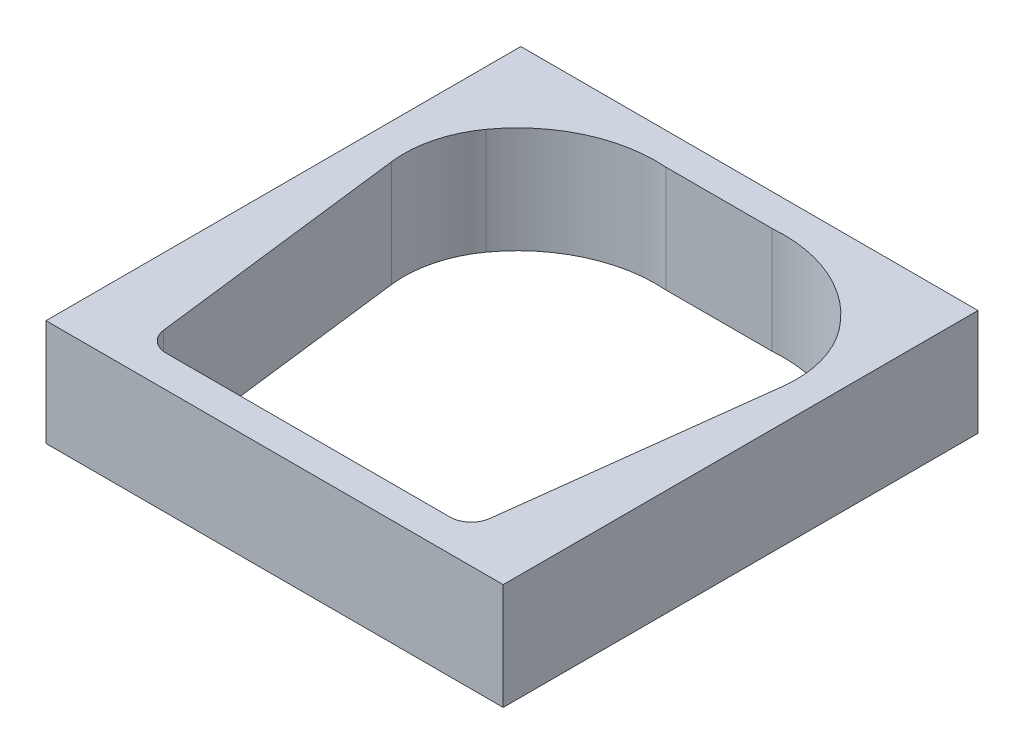
ISO-10303-21;
HEADER;
FILE_DESCRIPTION(('STEP AP214'),'2;1');
FILE_NAME('part.step','',(''),(''),'','','');
FILE_SCHEMA(('AUTOMOTIVE_DESIGN { 1 0 10303 214 1 1 1 1 }'));
ENDSEC;
DATA;
#1=APPLICATION_CONTEXT('core data for automotive mechanical design processes');
#2=APPLICATION_PROTOCOL_DEFINITION('international standard','automotive_design',2000,#1);
#3=PRODUCT_CONTEXT('',#1,'mechanical');
#4=PRODUCT('Part','Part','',(#3));
#5=PRODUCT_RELATED_PRODUCT_CATEGORY('part','',(#4));
#6=PRODUCT_DEFINITION_FORMATION('','',#4);
#7=PRODUCT_DEFINITION_CONTEXT('part definition',#1,'design');
#8=PRODUCT_DEFINITION('design','',#6,#7);
#9=PRODUCT_DEFINITION_SHAPE('','',#8);
#10=(LENGTH_UNIT() NAMED_UNIT(*) SI_UNIT(.MILLI.,.METRE.));
#11=(NAMED_UNIT(*) PLANE_ANGLE_UNIT() SI_UNIT($,.RADIAN.));
#12=(NAMED_UNIT(*) SI_UNIT($,.STERADIAN.) SOLID_ANGLE_UNIT());
#13=UNCERTAINTY_MEASURE_WITH_UNIT(LENGTH_MEASURE(1.E-05),#10,'distance_accuracy_value','');
#14=(GEOMETRIC_REPRESENTATION_CONTEXT(3) GLOBAL_UNCERTAINTY_ASSIGNED_CONTEXT((#13)) GLOBAL_UNIT_ASSIGNED_CONTEXT((#10,
#11,#12)) REPRESENTATION_CONTEXT('',''));
#15=CARTESIAN_POINT('',(0.,0.,0.));
#16=DIRECTION('',(0.,0.,1.));
#17=DIRECTION('',(1.,0.,0.));
#18=AXIS2_PLACEMENT_3D('',#15,#16,#17);
#19=CARTESIAN_POINT('',(12.657693959334,0.,2.96357615590343));
#20=DIRECTION('',(0.,-1.,0.));
#21=DIRECTION('',(0.,0.,-1.));
#22=AXIS2_PLACEMENT_3D('',#19,#20,#21);
#23=PLANE('',#22);
#24=DIRECTION('',(0.,0.,1.));
#25=VECTOR('',#24,1.);
#26=CARTESIAN_POINT('',(-3.,0.,31.6262943685429));
#27=LINE('',#26,#25);
#28=CARTESIAN_POINT('',(-3.,0.,-13.));
#29=VERTEX_POINT('',#28);
#30=CARTESIAN_POINT('',(-3.,0.,31.6262943685429));
#31=VERTEX_POINT('',#30);
#32=EDGE_CURVE('E206',#29,#31,#27,.T.);
#33=ORIENTED_EDGE('',*,*,#32,.F.);
#34=DIRECTION('',(-1.,0.,0.));
#35=VECTOR('',#34,1.);
#36=CARTESIAN_POINT('',(-3.,0.,-13.));
#37=LINE('',#36,#35);
#38=CARTESIAN_POINT('',(39.9705766235171,0.,-13.));
#39=VERTEX_POINT('',#38);
#40=EDGE_CURVE('E187',#39,#29,#37,.T.);
#41=ORIENTED_EDGE('',*,*,#40,.F.);
#42=DIRECTION('',(0.,0.,-1.));
#43=VECTOR('',#42,1.);
#44=CARTESIAN_POINT('',(39.9705766235171,0.,31.6262943685429));
#45=LINE('',#44,#43);
#46=CARTESIAN_POINT('',(39.9705766235171,0.,31.6262943685429));
#47=VERTEX_POINT('',#46);
#48=EDGE_CURVE('E200',#47,#39,#45,.T.);
#49=ORIENTED_EDGE('',*,*,#48,.F.);
#50=DIRECTION('',(1.,0.,0.));
#51=VECTOR('',#50,1.);
#52=CARTESIAN_POINT('',(-3.,0.,31.6262943685429));
#53=LINE('',#52,#51);
#54=EDGE_CURVE('E211',#31,#47,#53,.T.);
#55=ORIENTED_EDGE('',*,*,#54,.F.);
#56=EDGE_LOOP('',(#33,#41,#49,#55));
#57=FACE_BOUND('',#56,.T.);
#58=CARTESIAN_POINT('',(10.2236530300218,0.,1.20988155465921));
#59=DIRECTION('',(0.,-1.,0.));
#60=DIRECTION('',(0.,0.,-1.));
#61=AXIS2_PLACEMENT_3D('',#58,#59,#60);
#62=CIRCLE('',#61,10.);
#63=CARTESIAN_POINT('',(0.298191513608604,0.,2.42857498871066));
#64=VERTEX_POINT('',#63);
#65=CARTESIAN_POINT('',(2.1101832656479,0.,-4.63576711615484));
#66=VERTEX_POINT('',#65);
#67=EDGE_CURVE('E91',#64,#66,#62,.T.);
#68=ORIENTED_EDGE('',*,*,#67,.F.);
#69=DIRECTION('',(0.121869343405145,0.,0.992546151641322));
#70=VECTOR('',#69,1.);
#71=CARTESIAN_POINT('',(0.298191513608603,0.,2.42857498871065));
#72=LINE('',#71,#70);
#73=CARTESIAN_POINT('',(3.29922521014799,0.,26.8700330553532));
#74=VERTEX_POINT('',#73);
#75=EDGE_CURVE('E11',#64,#74,#72,.T.);
#76=ORIENTED_EDGE('',*,*,#75,.T.);
#77=CARTESIAN_POINT('',(5.28431751343064,0.,26.6262943685429));
#78=DIRECTION('',(0.,-1.,0.));
#79=DIRECTION('',(0.,0.,-1.));
#80=AXIS2_PLACEMENT_3D('',#77,#78,#79);
#81=CIRCLE('',#80,2.);
#82=CARTESIAN_POINT('',(5.28431751343065,0.,28.6262943685429));
#83=VERTEX_POINT('',#82);
#84=EDGE_CURVE('E48',#74,#83,#81,.F.);
#85=ORIENTED_EDGE('',*,*,#84,.T.);
#86=DIRECTION('',(1.,0.,0.));
#87=VECTOR('',#86,1.);
#88=CARTESIAN_POINT('',(12.657693959334,0.,28.6262943685429));
#89=LINE('',#88,#87);
#90=CARTESIAN_POINT('',(31.9760056227623,0.,28.626294368543));
#91=VERTEX_POINT('',#90);
#92=EDGE_CURVE('E133',#83,#91,#89,.T.);
#93=ORIENTED_EDGE('',*,*,#92,.T.);
#94=CARTESIAN_POINT('',(31.9760056227623,0.,26.6262943685429));
#95=DIRECTION('',(0.,-1.,0.));
#96=DIRECTION('',(0.,0.,-1.));
#97=AXIS2_PLACEMENT_3D('',#94,#95,#96);
#98=CIRCLE('',#97,2.00000000000001);
#99=CARTESIAN_POINT('',(33.961097926045,0.,26.8700330553532));
#100=VERTEX_POINT('',#99);
#101=EDGE_CURVE('E129',#91,#100,#98,.F.);
#102=ORIENTED_EDGE('',*,*,#101,.T.);
#103=DIRECTION('',(0.121869343405151,0.,-0.992546151641322));
#104=VECTOR('',#103,1.);
#105=CARTESIAN_POINT('',(33.961097926045,0.,26.8700330553533));
#106=LINE('',#105,#104);
#107=CARTESIAN_POINT('',(36.970576623517,2.22044604925031E-13,2.35979597553153));
#108=VERTEX_POINT('',#107);
#109=EDGE_CURVE('E116',#100,#108,#106,.T.);
#110=ORIENTED_EDGE('',*,*,#109,.T.);
#111=CARTESIAN_POINT('',(27.0451151071038,0.,1.14110254148002));
#112=DIRECTION('',(0.,-1.,0.));
#113=DIRECTION('',(0.,0.,-1.));
#114=AXIS2_PLACEMENT_3D('',#111,#112,#113);
#115=CIRCLE('',#114,10.);
#116=CARTESIAN_POINT('',(34.9994172411373,0.,-4.91934938560512));
#117=VERTEX_POINT('',#116);
#118=EDGE_CURVE('E112',#117,#108,#115,.T.);
#119=ORIENTED_EDGE('',*,*,#118,.F.);
#120=CARTESIAN_POINT('',(24.6588244668938,0.,2.95923811960556));
#121=DIRECTION('',(0.,-1.,0.));
#122=DIRECTION('',(0.,0.,-1.));
#123=AXIS2_PLACEMENT_3D('',#120,#121,#122);
#124=CIRCLE('',#123,13.);
#125=CARTESIAN_POINT('',(23.6301615680965,0.,-10.));
#126=VERTEX_POINT('',#125);
#127=EDGE_CURVE('E118',#126,#117,#124,.T.);
#128=ORIENTED_EDGE('',*,*,#127,.F.);
#129=DIRECTION('',(1.,0.,0.));
#130=VECTOR('',#129,1.);
#131=CARTESIAN_POINT('',(12.657693959334,0.,-10.));
#132=LINE('',#131,#130);
#133=CARTESIAN_POINT('',(13.6301615680965,0.,-10.));
#134=VERTEX_POINT('',#133);
#135=EDGE_CURVE('E122',#126,#134,#132,.F.);
#136=ORIENTED_EDGE('',*,*,#135,.T.);
#137=CARTESIAN_POINT('',(12.657693959334,0.,2.96357615590343));
#138=DIRECTION('',(0.,-1.,0.));
#139=DIRECTION('',(0.,0.,-1.));
#140=AXIS2_PLACEMENT_3D('',#137,#138,#139);
#141=CIRCLE('',#140,13.);
#142=EDGE_CURVE('E110',#66,#134,#141,.T.);
#143=ORIENTED_EDGE('',*,*,#142,.F.);
#144=EDGE_LOOP('',(#68,#76,#85,#93,#102,#110,#119,#128,#136,#143));
#145=FACE_BOUND('',#144,.T.);
#146=ADVANCED_FACE('F39',(#57,#145),#23,.T.);
#147=CARTESIAN_POINT('',(0.,10.,0.));
#148=DIRECTION('',(0.,-1.,0.));
#149=DIRECTION('',(0.,0.,-1.));
#150=AXIS2_PLACEMENT_3D('',#147,#148,#149);
#151=PLANE('',#150);
#152=DIRECTION('',(0.,0.,1.));
#153=VECTOR('',#152,1.);
#154=CARTESIAN_POINT('',(-3.,10.,31.6262943685429));
#155=LINE('',#154,#153);
#156=CARTESIAN_POINT('',(-3.,10.,-13.));
#157=VERTEX_POINT('',#156);
#158=CARTESIAN_POINT('',(-3.,10.,31.6262943685429));
#159=VERTEX_POINT('',#158);
#160=EDGE_CURVE('E199',#157,#159,#155,.T.);
#161=ORIENTED_EDGE('',*,*,#160,.T.);
#162=DIRECTION('',(1.,0.,0.));
#163=VECTOR('',#162,1.);
#164=CARTESIAN_POINT('',(-3.,10.,31.6262943685429));
#165=LINE('',#164,#163);
#166=CARTESIAN_POINT('',(39.9705766235171,10.,31.6262943685429));
#167=VERTEX_POINT('',#166);
#168=EDGE_CURVE('E311',#159,#167,#165,.T.);
#169=ORIENTED_EDGE('',*,*,#168,.T.);
#170=DIRECTION('',(0.,0.,-1.));
#171=VECTOR('',#170,1.);
#172=CARTESIAN_POINT('',(39.9705766235171,10.,31.6262943685429));
#173=LINE('',#172,#171);
#174=CARTESIAN_POINT('',(39.9705766235171,10.,-13.));
#175=VERTEX_POINT('',#174);
#176=EDGE_CURVE('E313',#167,#175,#173,.T.);
#177=ORIENTED_EDGE('',*,*,#176,.T.);
#178=DIRECTION('',(-1.,0.,0.));
#179=VECTOR('',#178,1.);
#180=CARTESIAN_POINT('',(-3.,10.,-13.));
#181=LINE('',#180,#179);
#182=EDGE_CURVE('E209',#175,#157,#181,.T.);
#183=ORIENTED_EDGE('',*,*,#182,.T.);
#184=EDGE_LOOP('',(#161,#169,#177,#183));
#185=FACE_BOUND('',#184,.T.);
#186=CARTESIAN_POINT('',(10.2236530300218,9.99999999999979,1.20988155465921));
#187=DIRECTION('',(0.,-1.,0.));
#188=DIRECTION('',(0.,0.,-1.));
#189=AXIS2_PLACEMENT_3D('',#186,#187,#188);
#190=CIRCLE('',#189,10.);
#191=CARTESIAN_POINT('',(0.298191513608606,10.0000000000001,2.42857498871065));
#192=VERTEX_POINT('',#191);
#193=CARTESIAN_POINT('',(2.1101832656479,10.,-4.63576711615484));
#194=VERTEX_POINT('',#193);
#195=EDGE_CURVE('E95',#192,#194,#190,.T.);
#196=ORIENTED_EDGE('',*,*,#195,.T.);
#197=CARTESIAN_POINT('',(12.657693959334,9.99999999999979,2.96357615590343));
#198=DIRECTION('',(0.,-1.,0.));
#199=DIRECTION('',(0.,0.,-1.));
#200=AXIS2_PLACEMENT_3D('',#197,#198,#199);
#201=CIRCLE('',#200,13.);
#202=CARTESIAN_POINT('',(13.6301615680965,9.9999999999999,-10.));
#203=VERTEX_POINT('',#202);
#204=EDGE_CURVE('E262',#194,#203,#201,.T.);
#205=ORIENTED_EDGE('',*,*,#204,.T.);
#206=DIRECTION('',(1.,0.,0.));
#207=VECTOR('',#206,1.);
#208=CARTESIAN_POINT('',(13.6301615680965,9.99999999999979,-10.));
#209=LINE('',#208,#207);
#210=CARTESIAN_POINT('',(23.6301615680965,9.99999999999979,-10.));
#211=VERTEX_POINT('',#210);
#212=EDGE_CURVE('E125',#203,#211,#209,.T.);
#213=ORIENTED_EDGE('',*,*,#212,.T.);
#214=CARTESIAN_POINT('',(24.6588244668938,9.99999999999979,2.95923811960556));
#215=DIRECTION('',(0.,-1.,0.));
#216=DIRECTION('',(0.,0.,-1.));
#217=AXIS2_PLACEMENT_3D('',#214,#215,#216);
#218=CIRCLE('',#217,13.);
#219=CARTESIAN_POINT('',(34.9994172411373,10.,-4.91934938560512));
#220=VERTEX_POINT('',#219);
#221=EDGE_CURVE('E235',#211,#220,#218,.T.);
#222=ORIENTED_EDGE('',*,*,#221,.T.);
#223=CARTESIAN_POINT('',(27.0451151071038,9.99999999999979,1.14110254148002));
#224=DIRECTION('',(0.,-1.,0.));
#225=DIRECTION('',(0.,0.,-1.));
#226=AXIS2_PLACEMENT_3D('',#223,#224,#225);
#227=CIRCLE('',#226,10.);
#228=CARTESIAN_POINT('',(36.970576623517,10.0000000000001,2.35979597553153));
#229=VERTEX_POINT('',#228);
#230=EDGE_CURVE('E239',#220,#229,#227,.T.);
#231=ORIENTED_EDGE('',*,*,#230,.T.);
#232=DIRECTION('',(-0.121869343405151,0.,0.992546151641322));
#233=VECTOR('',#232,1.);
#234=CARTESIAN_POINT('',(36.970576623517,9.99999999999979,2.35979597553153));
#235=LINE('',#234,#233);
#236=CARTESIAN_POINT('',(33.961097926045,9.99999999999979,26.8700330553532));
#237=VERTEX_POINT('',#236);
#238=EDGE_CURVE('E243',#229,#237,#235,.T.);
#239=ORIENTED_EDGE('',*,*,#238,.T.);
#240=CARTESIAN_POINT('',(31.9760056227623,9.99999999999979,26.6262943685429));
#241=DIRECTION('',(0.,-1.,0.));
#242=DIRECTION('',(0.,0.,-1.));
#243=AXIS2_PLACEMENT_3D('',#240,#241,#242);
#244=CIRCLE('',#243,2.);
#245=CARTESIAN_POINT('',(31.9760056227623,9.99999999999979,28.626294368543));
#246=VERTEX_POINT('',#245);
#247=EDGE_CURVE('E247',#237,#246,#244,.T.);
#248=ORIENTED_EDGE('',*,*,#247,.T.);
#249=DIRECTION('',(-1.,0.,0.));
#250=VECTOR('',#249,1.);
#251=CARTESIAN_POINT('',(5.28431751343065,9.99999999999979,28.6262943685429));
#252=LINE('',#251,#250);
#253=CARTESIAN_POINT('',(5.28431751343065,9.99999999999979,28.6262943685429));
#254=VERTEX_POINT('',#253);
#255=EDGE_CURVE('E251',#246,#254,#252,.T.);
#256=ORIENTED_EDGE('',*,*,#255,.T.);
#257=CARTESIAN_POINT('',(5.28431751343064,9.99999999999979,26.6262943685429));
#258=DIRECTION('',(0.,-1.,0.));
#259=DIRECTION('',(0.,0.,-1.));
#260=AXIS2_PLACEMENT_3D('',#257,#258,#259);
#261=CIRCLE('',#260,2.);
#262=CARTESIAN_POINT('',(3.29922521014799,9.99999999999979,26.8700330553532));
#263=VERTEX_POINT('',#262);
#264=EDGE_CURVE('E255',#254,#263,#261,.T.);
#265=ORIENTED_EDGE('',*,*,#264,.T.);
#266=DIRECTION('',(-0.121869343405144,0.,-0.992546151641323));
#267=VECTOR('',#266,1.);
#268=CARTESIAN_POINT('',(0.298191513608607,9.99999999999979,2.42857498871066));
#269=LINE('',#268,#267);
#270=EDGE_CURVE('E147',#263,#192,#269,.T.);
#271=ORIENTED_EDGE('',*,*,#270,.T.);
#272=EDGE_LOOP('',(#196,#205,#213,#222,#231,#239,#248,#256,#265,#271));
#273=FACE_BOUND('',#272,.T.);
#274=ADVANCED_FACE('F318',(#185,#273),#151,.F.);
#275=CARTESIAN_POINT('',(-3.,10.,31.6262943685429));
#276=DIRECTION('',(1.,0.,0.));
#277=DIRECTION('',(0.,0.,-1.));
#278=AXIS2_PLACEMENT_3D('',#275,#276,#277);
#279=PLANE('',#278);
#280=ORIENTED_EDGE('',*,*,#32,.T.);
#281=DIRECTION('',(0.,-1.,0.));
#282=VECTOR('',#281,1.);
#283=CARTESIAN_POINT('',(-3.,10.,31.6262943685429));
#284=LINE('',#283,#282);
#285=EDGE_CURVE('E232',#159,#31,#284,.T.);
#286=ORIENTED_EDGE('',*,*,#285,.F.);
#287=ORIENTED_EDGE('',*,*,#160,.F.);
#288=DIRECTION('',(0.,-1.,0.));
#289=VECTOR('',#288,1.);
#290=CARTESIAN_POINT('',(-3.,10.,-13.));
#291=LINE('',#290,#289);
#292=EDGE_CURVE('E191',#157,#29,#291,.T.);
#293=ORIENTED_EDGE('',*,*,#292,.T.);
#294=EDGE_LOOP('',(#280,#286,#287,#293));
#295=FACE_BOUND('',#294,.T.);
#296=ADVANCED_FACE('F204',(#295),#279,.F.);
#297=CARTESIAN_POINT('',(-3.,10.,31.6262943685429));
#298=DIRECTION('',(0.,0.,-1.));
#299=DIRECTION('',(-1.,0.,0.));
#300=AXIS2_PLACEMENT_3D('',#297,#298,#299);
#301=PLANE('',#300);
#302=ORIENTED_EDGE('',*,*,#54,.T.);
#303=DIRECTION('',(0.,-1.,0.));
#304=VECTOR('',#303,1.);
#305=CARTESIAN_POINT('',(39.9705766235171,10.,31.6262943685429));
#306=LINE('',#305,#304);
#307=EDGE_CURVE('E228',#167,#47,#306,.T.);
#308=ORIENTED_EDGE('',*,*,#307,.F.);
#309=ORIENTED_EDGE('',*,*,#168,.F.);
#310=ORIENTED_EDGE('',*,*,#285,.T.);
#311=EDGE_LOOP('',(#302,#308,#309,#310));
#312=FACE_BOUND('',#311,.T.);
#313=ADVANCED_FACE('F322',(#312),#301,.F.);
#314=CARTESIAN_POINT('',(39.9705766235171,10.,31.6262943685429));
#315=DIRECTION('',(-1.,0.,0.));
#316=DIRECTION('',(0.,0.,1.));
#317=AXIS2_PLACEMENT_3D('',#314,#315,#316);
#318=PLANE('',#317);
#319=ORIENTED_EDGE('',*,*,#48,.T.);
#320=DIRECTION('',(0.,-1.,0.));
#321=VECTOR('',#320,1.);
#322=CARTESIAN_POINT('',(39.9705766235171,10.,-13.));
#323=LINE('',#322,#321);
#324=EDGE_CURVE('E194',#175,#39,#323,.T.);
#325=ORIENTED_EDGE('',*,*,#324,.F.);
#326=ORIENTED_EDGE('',*,*,#176,.F.);
#327=ORIENTED_EDGE('',*,*,#307,.T.);
#328=EDGE_LOOP('',(#319,#325,#326,#327));
#329=FACE_BOUND('',#328,.T.);
#330=ADVANCED_FACE('F324',(#329),#318,.F.);
#331=CARTESIAN_POINT('',(-3.,10.,-13.));
#332=DIRECTION('',(0.,0.,1.));
#333=DIRECTION('',(1.,0.,0.));
#334=AXIS2_PLACEMENT_3D('',#331,#332,#333);
#335=PLANE('',#334);
#336=ORIENTED_EDGE('',*,*,#40,.T.);
#337=ORIENTED_EDGE('',*,*,#292,.F.);
#338=ORIENTED_EDGE('',*,*,#182,.F.);
#339=ORIENTED_EDGE('',*,*,#324,.T.);
#340=EDGE_LOOP('',(#336,#337,#338,#339));
#341=FACE_BOUND('',#340,.T.);
#342=ADVANCED_FACE('F189',(#341),#335,.F.);
#343=CARTESIAN_POINT('',(12.657693959334,-1.2E-05,2.96357615590343));
#344=DIRECTION('',(0.,1.,0.));
#345=DIRECTION('',(0.,0.,1.));
#346=AXIS2_PLACEMENT_3D('',#343,#344,#345);
#347=CYLINDRICAL_SURFACE('',#346,13.);
#348=DIRECTION('',(0.,1.,0.));
#349=VECTOR('',#348,1.);
#350=CARTESIAN_POINT('',(2.1101832656479,-1.2E-05,-4.63576711615484));
#351=LINE('',#350,#349);
#352=EDGE_CURVE('E100',#66,#194,#351,.T.);
#353=ORIENTED_EDGE('',*,*,#352,.F.);
#354=ORIENTED_EDGE('',*,*,#142,.T.);
#355=DIRECTION('',(0.,-1.,0.));
#356=VECTOR('',#355,1.);
#357=CARTESIAN_POINT('',(13.6301615680965,2133.6,-10.));
#358=LINE('',#357,#356);
#359=EDGE_CURVE('E56',#203,#134,#358,.T.);
#360=ORIENTED_EDGE('',*,*,#359,.F.);
#361=ORIENTED_EDGE('',*,*,#204,.F.);
#362=EDGE_LOOP('',(#353,#354,#360,#361));
#363=FACE_BOUND('',#362,.T.);
#364=ADVANCED_FACE('F331',(#363),#347,.F.);
#365=CARTESIAN_POINT('',(24.6588244668938,-1.2E-05,2.95923811960556));
#366=DIRECTION('',(0.,1.,0.));
#367=DIRECTION('',(0.,0.,1.));
#368=AXIS2_PLACEMENT_3D('',#365,#366,#367);
#369=CYLINDRICAL_SURFACE('',#368,13.);
#370=DIRECTION('',(0.,-1.,0.));
#371=VECTOR('',#370,1.);
#372=CARTESIAN_POINT('',(23.6301615680965,2133.6,-10.));
#373=LINE('',#372,#371);
#374=EDGE_CURVE('E275',#211,#126,#373,.T.);
#375=ORIENTED_EDGE('',*,*,#374,.T.);
#376=ORIENTED_EDGE('',*,*,#127,.T.);
#377=DIRECTION('',(0.,1.,0.));
#378=VECTOR('',#377,1.);
#379=CARTESIAN_POINT('',(34.9994172411373,-1.2E-05,-4.91934938560512));
#380=LINE('',#379,#378);
#381=EDGE_CURVE('E214',#117,#220,#380,.T.);
#382=ORIENTED_EDGE('',*,*,#381,.T.);
#383=ORIENTED_EDGE('',*,*,#221,.F.);
#384=EDGE_LOOP('',(#375,#376,#382,#383));
#385=FACE_BOUND('',#384,.T.);
#386=ADVANCED_FACE('F273',(#385),#369,.F.);
#387=CARTESIAN_POINT('',(27.0451151071038,-1.2E-05,1.14110254148002));
#388=DIRECTION('',(0.,1.,0.));
#389=DIRECTION('',(0.,0.,1.));
#390=AXIS2_PLACEMENT_3D('',#387,#388,#389);
#391=CYLINDRICAL_SURFACE('',#390,10.);
#392=ORIENTED_EDGE('',*,*,#381,.F.);
#393=ORIENTED_EDGE('',*,*,#118,.T.);
#394=DIRECTION('',(0.,-1.,0.));
#395=VECTOR('',#394,1.);
#396=CARTESIAN_POINT('',(36.970576623517,2133.6,2.35979597553153));
#397=LINE('',#396,#395);
#398=EDGE_CURVE('E287',#229,#108,#397,.T.);
#399=ORIENTED_EDGE('',*,*,#398,.F.);
#400=ORIENTED_EDGE('',*,*,#230,.F.);
#401=EDGE_LOOP('',(#392,#393,#399,#400));
#402=FACE_BOUND('',#401,.T.);
#403=ADVANCED_FACE('F278',(#402),#391,.F.);
#404=CARTESIAN_POINT('',(10.2236530300218,-1.2E-05,1.20988155465921));
#405=DIRECTION('',(0.,1.,0.));
#406=DIRECTION('',(0.,0.,1.));
#407=AXIS2_PLACEMENT_3D('',#404,#405,#406);
#408=CYLINDRICAL_SURFACE('',#407,10.);
#409=DIRECTION('',(0.,-1.,0.));
#410=VECTOR('',#409,1.);
#411=CARTESIAN_POINT('',(0.298191513608605,2133.6,2.42857498871065));
#412=LINE('',#411,#410);
#413=EDGE_CURVE('E85',#192,#64,#412,.T.);
#414=ORIENTED_EDGE('',*,*,#413,.T.);
#415=ORIENTED_EDGE('',*,*,#67,.T.);
#416=ORIENTED_EDGE('',*,*,#352,.T.);
#417=ORIENTED_EDGE('',*,*,#195,.F.);
#418=EDGE_LOOP('',(#414,#415,#416,#417));
#419=FACE_BOUND('',#418,.T.);
#420=ADVANCED_FACE('F87',(#419),#408,.F.);
#421=CARTESIAN_POINT('',(0.298191513608605,2133.6,2.42857498871065));
#422=DIRECTION('',(0.992546151641322,0.,-0.121869343405144));
#423=DIRECTION('',(-0.121869343405145,0.,-0.992546151641323));
#424=AXIS2_PLACEMENT_3D('',#421,#422,#423);
#425=PLANE('',#424);
#426=ORIENTED_EDGE('',*,*,#270,.F.);
#427=DIRECTION('',(0.,-1.,0.));
#428=VECTOR('',#427,1.);
#429=CARTESIAN_POINT('',(3.29922521014799,2133.6,26.8700330553532));
#430=LINE('',#429,#428);
#431=EDGE_CURVE('E101',#263,#74,#430,.T.);
#432=ORIENTED_EDGE('',*,*,#431,.T.);
#433=ORIENTED_EDGE('',*,*,#75,.F.);
#434=ORIENTED_EDGE('',*,*,#413,.F.);
#435=EDGE_LOOP('',(#426,#432,#433,#434));
#436=FACE_BOUND('',#435,.T.);
#437=ADVANCED_FACE('F104',(#436),#425,.T.);
#438=CARTESIAN_POINT('',(5.28431751343064,2133.6,26.6262943685429));
#439=DIRECTION('',(0.,-1.,0.));
#440=DIRECTION('',(0.,0.,-1.));
#441=AXIS2_PLACEMENT_3D('',#438,#439,#440);
#442=CYLINDRICAL_SURFACE('',#441,2.);
#443=ORIENTED_EDGE('',*,*,#264,.F.);
#444=DIRECTION('',(0.,-1.,0.));
#445=VECTOR('',#444,1.);
#446=CARTESIAN_POINT('',(5.28431751343065,2133.6,28.6262943685429));
#447=LINE('',#446,#445);
#448=EDGE_CURVE('E144',#254,#83,#447,.T.);
#449=ORIENTED_EDGE('',*,*,#448,.T.);
#450=ORIENTED_EDGE('',*,*,#84,.F.);
#451=ORIENTED_EDGE('',*,*,#431,.F.);
#452=EDGE_LOOP('',(#443,#449,#450,#451));
#453=FACE_BOUND('',#452,.T.);
#454=ADVANCED_FACE('F141',(#453),#442,.F.);
#455=CARTESIAN_POINT('',(5.28431751343065,2133.6,28.6262943685429));
#456=DIRECTION('',(0.,0.,-1.));
#457=DIRECTION('',(-1.,0.,0.));
#458=AXIS2_PLACEMENT_3D('',#455,#456,#457);
#459=PLANE('',#458);
#460=ORIENTED_EDGE('',*,*,#255,.F.);
#461=DIRECTION('',(0.,-1.,0.));
#462=VECTOR('',#461,1.);
#463=CARTESIAN_POINT('',(31.9760056227623,2133.6,28.626294368543));
#464=LINE('',#463,#462);
#465=EDGE_CURVE('E294',#246,#91,#464,.T.);
#466=ORIENTED_EDGE('',*,*,#465,.T.);
#467=ORIENTED_EDGE('',*,*,#92,.F.);
#468=ORIENTED_EDGE('',*,*,#448,.F.);
#469=EDGE_LOOP('',(#460,#466,#467,#468));
#470=FACE_BOUND('',#469,.T.);
#471=ADVANCED_FACE('F356',(#470),#459,.T.);
#472=CARTESIAN_POINT('',(31.9760056227623,2133.6,26.6262943685429));
#473=DIRECTION('',(0.,-1.,0.));
#474=DIRECTION('',(0.,0.,-1.));
#475=AXIS2_PLACEMENT_3D('',#472,#473,#474);
#476=CYLINDRICAL_SURFACE('',#475,2.00000000000001);
#477=ORIENTED_EDGE('',*,*,#247,.F.);
#478=DIRECTION('',(0.,-1.,0.));
#479=VECTOR('',#478,1.);
#480=CARTESIAN_POINT('',(33.961097926045,2133.6,26.8700330553532));
#481=LINE('',#480,#479);
#482=EDGE_CURVE('E286',#237,#100,#481,.T.);
#483=ORIENTED_EDGE('',*,*,#482,.T.);
#484=ORIENTED_EDGE('',*,*,#101,.F.);
#485=ORIENTED_EDGE('',*,*,#465,.F.);
#486=EDGE_LOOP('',(#477,#483,#484,#485));
#487=FACE_BOUND('',#486,.T.);
#488=ADVANCED_FACE('F290',(#487),#476,.F.);
#489=CARTESIAN_POINT('',(33.961097926045,2133.6,26.8700330553532));
#490=DIRECTION('',(-0.992546151641322,0.,-0.121869343405151));
#491=DIRECTION('',(-0.121869343405151,0.,0.992546151641322));
#492=AXIS2_PLACEMENT_3D('',#489,#490,#491);
#493=PLANE('',#492);
#494=ORIENTED_EDGE('',*,*,#238,.F.);
#495=ORIENTED_EDGE('',*,*,#398,.T.);
#496=ORIENTED_EDGE('',*,*,#109,.F.);
#497=ORIENTED_EDGE('',*,*,#482,.F.);
#498=EDGE_LOOP('',(#494,#495,#496,#497));
#499=FACE_BOUND('',#498,.T.);
#500=ADVANCED_FACE('F285',(#499),#493,.T.);
#501=CARTESIAN_POINT('',(23.6301615680965,2133.6,-10.));
#502=DIRECTION('',(0.,0.,1.));
#503=DIRECTION('',(1.,0.,0.));
#504=AXIS2_PLACEMENT_3D('',#501,#502,#503);
#505=PLANE('',#504);
#506=ORIENTED_EDGE('',*,*,#212,.F.);
#507=ORIENTED_EDGE('',*,*,#359,.T.);
#508=ORIENTED_EDGE('',*,*,#135,.F.);
#509=ORIENTED_EDGE('',*,*,#374,.F.);
#510=EDGE_LOOP('',(#506,#507,#508,#509));
#511=FACE_BOUND('',#510,.T.);
#512=ADVANCED_FACE('F364',(#511),#505,.T.);
#513=CLOSED_SHELL('',(#146,#274,#296,#313,#330,#342,#364,#386,#403,#420,#437,#454,#471,#488,
#500,#512));
#514=MANIFOLD_SOLID_BREP('B2',#513);
#515=ADVANCED_BREP_SHAPE_REPRESENTATION('',(#18,#514),#14);
#516=SHAPE_DEFINITION_REPRESENTATION(#9,#515);
ENDSEC;
END-ISO-10303-21;
